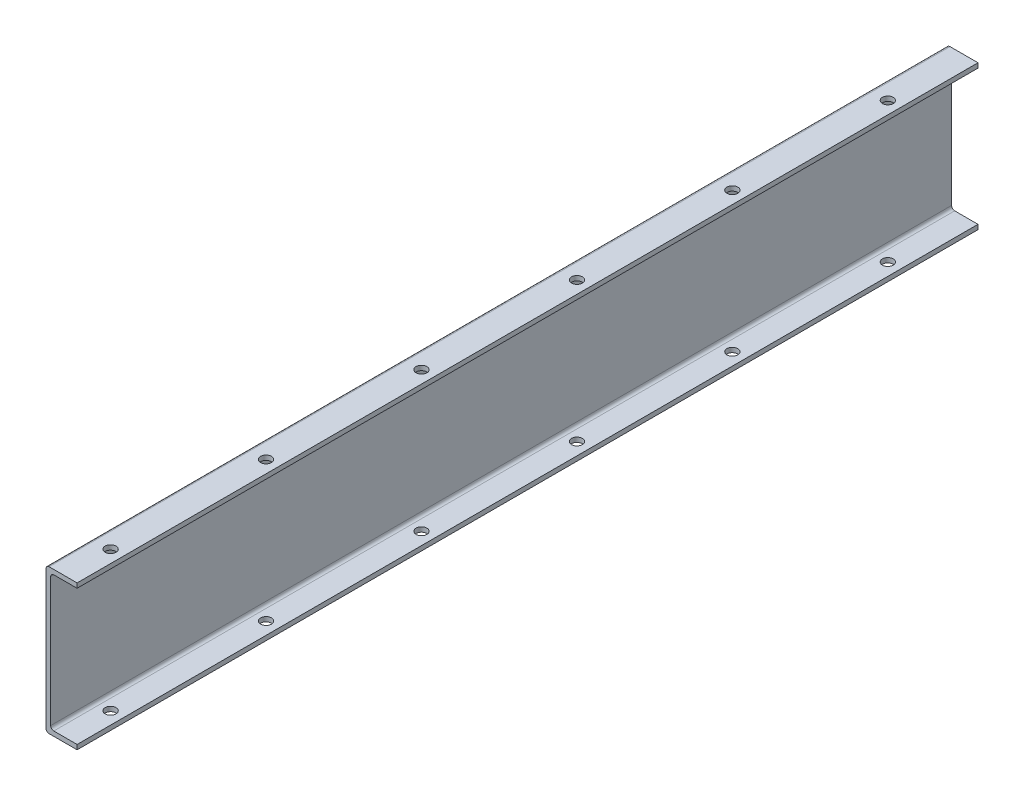
ISO-10303-21;
HEADER;
FILE_DESCRIPTION(('STEP AP214'),'2;1');
FILE_NAME('part.step','',(''),(''),'','','');
FILE_SCHEMA(('AUTOMOTIVE_DESIGN { 1 0 10303 214 1 1 1 1 }'));
ENDSEC;
DATA;
#1=APPLICATION_CONTEXT('core data for automotive mechanical design processes');
#2=APPLICATION_PROTOCOL_DEFINITION('international standard','automotive_design',2000,#1);
#3=PRODUCT_CONTEXT('',#1,'mechanical');
#4=PRODUCT('Part','Part','',(#3));
#5=PRODUCT_RELATED_PRODUCT_CATEGORY('part','',(#4));
#6=PRODUCT_DEFINITION_FORMATION('','',#4);
#7=PRODUCT_DEFINITION_CONTEXT('part definition',#1,'design');
#8=PRODUCT_DEFINITION('design','',#6,#7);
#9=PRODUCT_DEFINITION_SHAPE('','',#8);
#10=(LENGTH_UNIT() NAMED_UNIT(*) SI_UNIT(.MILLI.,.METRE.));
#11=(NAMED_UNIT(*) PLANE_ANGLE_UNIT() SI_UNIT($,.RADIAN.));
#12=(NAMED_UNIT(*) SI_UNIT($,.STERADIAN.) SOLID_ANGLE_UNIT());
#13=UNCERTAINTY_MEASURE_WITH_UNIT(LENGTH_MEASURE(1.E-05),#10,'distance_accuracy_value','');
#14=(GEOMETRIC_REPRESENTATION_CONTEXT(3) GLOBAL_UNCERTAINTY_ASSIGNED_CONTEXT((#13)) GLOBAL_UNIT_ASSIGNED_CONTEXT((#10,
#11,#12)) REPRESENTATION_CONTEXT('',''));
#15=CARTESIAN_POINT('',(0.,0.,0.));
#16=DIRECTION('',(0.,0.,1.));
#17=DIRECTION('',(1.,0.,0.));
#18=AXIS2_PLACEMENT_3D('',#15,#16,#17);
#19=CARTESIAN_POINT('',(0.75,0.,289.77));
#20=DIRECTION('',(1.,0.,0.));
#21=DIRECTION('',(0.,1.,0.));
#22=AXIS2_PLACEMENT_3D('',#19,#20,#21);
#23=PLANE('',#22);
#24=DIRECTION('',(0.,-1.,0.));
#25=VECTOR('',#24,1.);
#26=CARTESIAN_POINT('',(0.75,0.,289.77));
#27=LINE('',#26,#25);
#28=CARTESIAN_POINT('',(0.749999999999998,20.75,289.77));
#29=VERTEX_POINT('',#28);
#30=CARTESIAN_POINT('',(0.750000000000003,-20.75,289.77));
#31=VERTEX_POINT('',#30);
#32=EDGE_CURVE('E139',#29,#31,#27,.T.);
#33=ORIENTED_EDGE('',*,*,#32,.T.);
#34=DIRECTION('',(0.,0.,-1.));
#35=VECTOR('',#34,1.);
#36=CARTESIAN_POINT('',(0.750000000000003,-20.75,0.));
#37=LINE('',#36,#35);
#38=CARTESIAN_POINT('',(0.750000000000003,-20.75,0.));
#39=VERTEX_POINT('',#38);
#40=EDGE_CURVE('E195',#31,#39,#37,.T.);
#41=ORIENTED_EDGE('',*,*,#40,.T.);
#42=DIRECTION('',(0.,-1.,0.));
#43=VECTOR('',#42,1.);
#44=CARTESIAN_POINT('',(0.75,0.,0.));
#45=LINE('',#44,#43);
#46=CARTESIAN_POINT('',(0.749999999999998,20.75,0.));
#47=VERTEX_POINT('',#46);
#48=EDGE_CURVE('E169',#47,#39,#45,.T.);
#49=ORIENTED_EDGE('',*,*,#48,.F.);
#50=DIRECTION('',(0.,0.,-1.));
#51=VECTOR('',#50,1.);
#52=CARTESIAN_POINT('',(0.749999999999998,20.75,289.77));
#53=LINE('',#52,#51);
#54=EDGE_CURVE('E149',#47,#29,#53,.F.);
#55=ORIENTED_EDGE('',*,*,#54,.T.);
#56=EDGE_LOOP('',(#33,#41,#49,#55));
#57=FACE_BOUND('',#56,.T.);
#58=ADVANCED_FACE('F37',(#57),#23,.T.);
#59=CARTESIAN_POINT('',(0.,21.75,289.77));
#60=DIRECTION('',(0.,1.,0.));
#61=DIRECTION('',(0.,0.,1.));
#62=AXIS2_PLACEMENT_3D('',#59,#60,#61);
#63=PLANE('',#62);
#64=CARTESIAN_POINT('',(5.25000000000003,21.75,75.));
#65=DIRECTION('',(0.,1.,0.));
#66=DIRECTION('',(0.,0.,1.));
#67=AXIS2_PLACEMENT_3D('',#64,#65,#66);
#68=CIRCLE('',#67,1.75);
#69=CARTESIAN_POINT('',(5.25000000000003,21.75,76.75));
#70=VERTEX_POINT('',#69);
#71=EDGE_CURVE('E264',#70,#70,#68,.T.);
#72=ORIENTED_EDGE('',*,*,#71,.T.);
#73=EDGE_LOOP('',(#72));
#74=FACE_BOUND('',#73,.T.);
#75=CARTESIAN_POINT('',(5.25000000000002,21.75,125.));
#76=DIRECTION('',(0.,1.,0.));
#77=DIRECTION('',(0.,0.,1.));
#78=AXIS2_PLACEMENT_3D('',#75,#76,#77);
#79=CIRCLE('',#78,1.75);
#80=CARTESIAN_POINT('',(5.25000000000002,21.75,126.75));
#81=VERTEX_POINT('',#80);
#82=EDGE_CURVE('E249',#81,#81,#79,.T.);
#83=ORIENTED_EDGE('',*,*,#82,.T.);
#84=EDGE_LOOP('',(#83));
#85=FACE_BOUND('',#84,.T.);
#86=CARTESIAN_POINT('',(5.25000000000002,21.75,175.));
#87=DIRECTION('',(0.,1.,0.));
#88=DIRECTION('',(0.,0.,1.));
#89=AXIS2_PLACEMENT_3D('',#86,#87,#88);
#90=CIRCLE('',#89,1.75);
#91=CARTESIAN_POINT('',(5.25000000000002,21.75,176.75));
#92=VERTEX_POINT('',#91);
#93=EDGE_CURVE('E245',#92,#92,#90,.T.);
#94=ORIENTED_EDGE('',*,*,#93,.T.);
#95=EDGE_LOOP('',(#94));
#96=FACE_BOUND('',#95,.T.);
#97=CARTESIAN_POINT('',(5.25000000000001,21.75,225.));
#98=DIRECTION('',(0.,1.,0.));
#99=DIRECTION('',(0.,0.,1.));
#100=AXIS2_PLACEMENT_3D('',#97,#98,#99);
#101=CIRCLE('',#100,1.75);
#102=CARTESIAN_POINT('',(5.25000000000001,21.75,226.75));
#103=VERTEX_POINT('',#102);
#104=EDGE_CURVE('E241',#103,#103,#101,.T.);
#105=ORIENTED_EDGE('',*,*,#104,.T.);
#106=EDGE_LOOP('',(#105));
#107=FACE_BOUND('',#106,.T.);
#108=CARTESIAN_POINT('',(5.25,21.75,275.));
#109=DIRECTION('',(0.,1.,0.));
#110=DIRECTION('',(0.,0.,1.));
#111=AXIS2_PLACEMENT_3D('',#108,#109,#110);
#112=CIRCLE('',#111,1.75);
#113=CARTESIAN_POINT('',(5.25,21.75,276.75));
#114=VERTEX_POINT('',#113);
#115=EDGE_CURVE('E237',#114,#114,#112,.T.);
#116=ORIENTED_EDGE('',*,*,#115,.T.);
#117=EDGE_LOOP('',(#116));
#118=FACE_BOUND('',#117,.T.);
#119=CARTESIAN_POINT('',(5.25000000000003,21.75,25.));
#120=DIRECTION('',(0.,1.,0.));
#121=DIRECTION('',(0.,0.,1.));
#122=AXIS2_PLACEMENT_3D('',#119,#120,#121);
#123=CIRCLE('',#122,1.75);
#124=CARTESIAN_POINT('',(5.25000000000003,21.75,26.75));
#125=VERTEX_POINT('',#124);
#126=EDGE_CURVE('E172',#125,#125,#123,.T.);
#127=ORIENTED_EDGE('',*,*,#126,.T.);
#128=EDGE_LOOP('',(#127));
#129=FACE_BOUND('',#128,.T.);
#130=DIRECTION('',(1.,0.,0.));
#131=VECTOR('',#130,1.);
#132=CARTESIAN_POINT('',(0.,21.75,289.77));
#133=LINE('',#132,#131);
#134=CARTESIAN_POINT('',(1.75,21.75,289.77));
#135=VERTEX_POINT('',#134);
#136=CARTESIAN_POINT('',(9.25,21.75,289.77));
#137=VERTEX_POINT('',#136);
#138=EDGE_CURVE('E128',#135,#137,#133,.T.);
#139=ORIENTED_EDGE('',*,*,#138,.F.);
#140=DIRECTION('',(0.,0.,-1.));
#141=VECTOR('',#140,1.);
#142=CARTESIAN_POINT('',(1.75,21.75,289.77));
#143=LINE('',#142,#141);
#144=CARTESIAN_POINT('',(1.75,21.75,0.));
#145=VERTEX_POINT('',#144);
#146=EDGE_CURVE('E200',#135,#145,#143,.T.);
#147=ORIENTED_EDGE('',*,*,#146,.T.);
#148=DIRECTION('',(1.,0.,0.));
#149=VECTOR('',#148,1.);
#150=CARTESIAN_POINT('',(0.,21.75,0.));
#151=LINE('',#150,#149);
#152=CARTESIAN_POINT('',(9.25,21.75,0.));
#153=VERTEX_POINT('',#152);
#154=EDGE_CURVE('E145',#145,#153,#151,.T.);
#155=ORIENTED_EDGE('',*,*,#154,.T.);
#156=DIRECTION('',(0.,0.,-1.));
#157=VECTOR('',#156,1.);
#158=CARTESIAN_POINT('',(9.25,21.75,289.77));
#159=LINE('',#158,#157);
#160=EDGE_CURVE('E142',#137,#153,#159,.T.);
#161=ORIENTED_EDGE('',*,*,#160,.F.);
#162=EDGE_LOOP('',(#139,#147,#155,#161));
#163=FACE_BOUND('',#162,.T.);
#164=ADVANCED_FACE('F143',(#74,#85,#96,#107,#118,#129,#163),#63,.F.);
#165=CARTESIAN_POINT('',(9.25,0.,289.77));
#166=DIRECTION('',(-1.,0.,0.));
#167=DIRECTION('',(0.,0.,1.));
#168=AXIS2_PLACEMENT_3D('',#165,#166,#167);
#169=PLANE('',#168);
#170=DIRECTION('',(0.,1.,0.));
#171=VECTOR('',#170,1.);
#172=CARTESIAN_POINT('',(9.25,0.,0.));
#173=LINE('',#172,#171);
#174=CARTESIAN_POINT('',(9.25,23.25,0.));
#175=VERTEX_POINT('',#174);
#176=EDGE_CURVE('E174',#153,#175,#173,.T.);
#177=ORIENTED_EDGE('',*,*,#176,.T.);
#178=DIRECTION('',(0.,0.,-1.));
#179=VECTOR('',#178,1.);
#180=CARTESIAN_POINT('',(9.25,23.25,289.77));
#181=LINE('',#180,#179);
#182=CARTESIAN_POINT('',(9.25,23.25,289.77));
#183=VERTEX_POINT('',#182);
#184=EDGE_CURVE('E150',#183,#175,#181,.T.);
#185=ORIENTED_EDGE('',*,*,#184,.F.);
#186=DIRECTION('',(0.,1.,0.));
#187=VECTOR('',#186,1.);
#188=CARTESIAN_POINT('',(9.25,0.,289.77));
#189=LINE('',#188,#187);
#190=EDGE_CURVE('E132',#137,#183,#189,.T.);
#191=ORIENTED_EDGE('',*,*,#190,.F.);
#192=ORIENTED_EDGE('',*,*,#160,.T.);
#193=EDGE_LOOP('',(#177,#185,#191,#192));
#194=FACE_BOUND('',#193,.T.);
#195=ADVANCED_FACE('F152',(#194),#169,.F.);
#196=CARTESIAN_POINT('',(0.,23.25,289.77));
#197=DIRECTION('',(0.,1.,0.));
#198=DIRECTION('',(0.,0.,1.));
#199=AXIS2_PLACEMENT_3D('',#196,#197,#198);
#200=PLANE('',#199);
#201=CARTESIAN_POINT('',(5.25000000000003,23.25,75.));
#202=DIRECTION('',(0.,1.,0.));
#203=DIRECTION('',(0.,0.,1.));
#204=AXIS2_PLACEMENT_3D('',#201,#202,#203);
#205=CIRCLE('',#204,1.75);
#206=CARTESIAN_POINT('',(5.25000000000003,23.25,76.75));
#207=VERTEX_POINT('',#206);
#208=EDGE_CURVE('E261',#207,#207,#205,.T.);
#209=ORIENTED_EDGE('',*,*,#208,.F.);
#210=EDGE_LOOP('',(#209));
#211=FACE_BOUND('',#210,.T.);
#212=CARTESIAN_POINT('',(5.25000000000002,23.25,125.));
#213=DIRECTION('',(0.,1.,0.));
#214=DIRECTION('',(0.,0.,1.));
#215=AXIS2_PLACEMENT_3D('',#212,#213,#214);
#216=CIRCLE('',#215,1.75);
#217=CARTESIAN_POINT('',(5.25000000000002,23.25,126.75));
#218=VERTEX_POINT('',#217);
#219=EDGE_CURVE('E244',#218,#218,#216,.T.);
#220=ORIENTED_EDGE('',*,*,#219,.F.);
#221=EDGE_LOOP('',(#220));
#222=FACE_BOUND('',#221,.T.);
#223=CARTESIAN_POINT('',(5.25000000000002,23.25,175.));
#224=DIRECTION('',(0.,1.,0.));
#225=DIRECTION('',(0.,0.,1.));
#226=AXIS2_PLACEMENT_3D('',#223,#224,#225);
#227=CIRCLE('',#226,1.75);
#228=CARTESIAN_POINT('',(5.25000000000002,23.25,176.75));
#229=VERTEX_POINT('',#228);
#230=EDGE_CURVE('E240',#229,#229,#227,.T.);
#231=ORIENTED_EDGE('',*,*,#230,.F.);
#232=EDGE_LOOP('',(#231));
#233=FACE_BOUND('',#232,.T.);
#234=CARTESIAN_POINT('',(5.25000000000001,23.25,225.));
#235=DIRECTION('',(0.,1.,0.));
#236=DIRECTION('',(0.,0.,1.));
#237=AXIS2_PLACEMENT_3D('',#234,#235,#236);
#238=CIRCLE('',#237,1.75);
#239=CARTESIAN_POINT('',(5.25000000000001,23.25,226.75));
#240=VERTEX_POINT('',#239);
#241=EDGE_CURVE('E236',#240,#240,#238,.T.);
#242=ORIENTED_EDGE('',*,*,#241,.F.);
#243=EDGE_LOOP('',(#242));
#244=FACE_BOUND('',#243,.T.);
#245=CARTESIAN_POINT('',(5.25,23.25,275.));
#246=DIRECTION('',(0.,1.,0.));
#247=DIRECTION('',(0.,0.,1.));
#248=AXIS2_PLACEMENT_3D('',#245,#246,#247);
#249=CIRCLE('',#248,1.75);
#250=CARTESIAN_POINT('',(5.25,23.25,276.75));
#251=VERTEX_POINT('',#250);
#252=EDGE_CURVE('E231',#251,#251,#249,.T.);
#253=ORIENTED_EDGE('',*,*,#252,.F.);
#254=EDGE_LOOP('',(#253));
#255=FACE_BOUND('',#254,.T.);
#256=CARTESIAN_POINT('',(5.25000000000003,23.25,25.));
#257=DIRECTION('',(0.,1.,0.));
#258=DIRECTION('',(0.,0.,1.));
#259=AXIS2_PLACEMENT_3D('',#256,#257,#258);
#260=CIRCLE('',#259,1.75);
#261=CARTESIAN_POINT('',(5.25000000000003,23.25,26.75));
#262=VERTEX_POINT('',#261);
#263=EDGE_CURVE('E226',#262,#262,#260,.T.);
#264=ORIENTED_EDGE('',*,*,#263,.F.);
#265=EDGE_LOOP('',(#264));
#266=FACE_BOUND('',#265,.T.);
#267=DIRECTION('',(1.,0.,0.));
#268=VECTOR('',#267,1.);
#269=CARTESIAN_POINT('',(0.,23.25,0.));
#270=LINE('',#269,#268);
#271=CARTESIAN_POINT('',(0.249999999999997,23.25,0.));
#272=VERTEX_POINT('',#271);
#273=EDGE_CURVE('E176',#272,#175,#270,.T.);
#274=ORIENTED_EDGE('',*,*,#273,.F.);
#275=DIRECTION('',(0.,0.,-1.));
#276=VECTOR('',#275,1.);
#277=CARTESIAN_POINT('',(0.249999999999997,23.25,289.77));
#278=LINE('',#277,#276);
#279=CARTESIAN_POINT('',(0.249999999999997,23.25,289.77));
#280=VERTEX_POINT('',#279);
#281=EDGE_CURVE('E62',#272,#280,#278,.F.);
#282=ORIENTED_EDGE('',*,*,#281,.T.);
#283=DIRECTION('',(1.,0.,0.));
#284=VECTOR('',#283,1.);
#285=CARTESIAN_POINT('',(0.,23.25,289.77));
#286=LINE('',#285,#284);
#287=EDGE_CURVE('E154',#280,#183,#286,.T.);
#288=ORIENTED_EDGE('',*,*,#287,.T.);
#289=ORIENTED_EDGE('',*,*,#184,.T.);
#290=EDGE_LOOP('',(#274,#282,#288,#289));
#291=FACE_BOUND('',#290,.T.);
#292=ADVANCED_FACE('F307',(#211,#222,#233,#244,#255,#266,#291),#200,.T.);
#293=CARTESIAN_POINT('',(-0.75,0.,289.77));
#294=DIRECTION('',(1.,0.,0.));
#295=DIRECTION('',(0.,1.,0.));
#296=AXIS2_PLACEMENT_3D('',#293,#294,#295);
#297=PLANE('',#296);
#298=DIRECTION('',(0.,-1.,0.));
#299=VECTOR('',#298,1.);
#300=CARTESIAN_POINT('',(-0.75,0.,289.77));
#301=LINE('',#300,#299);
#302=CARTESIAN_POINT('',(-0.750000000000003,22.25,289.77));
#303=VERTEX_POINT('',#302);
#304=CARTESIAN_POINT('',(-0.749999999999997,-22.25,289.77));
#305=VERTEX_POINT('',#304);
#306=EDGE_CURVE('E156',#303,#305,#301,.T.);
#307=ORIENTED_EDGE('',*,*,#306,.F.);
#308=DIRECTION('',(0.,0.,-1.));
#309=VECTOR('',#308,1.);
#310=CARTESIAN_POINT('',(-0.750000000000003,22.25,0.));
#311=LINE('',#310,#309);
#312=CARTESIAN_POINT('',(-0.750000000000003,22.25,0.));
#313=VERTEX_POINT('',#312);
#314=EDGE_CURVE('E204',#303,#313,#311,.T.);
#315=ORIENTED_EDGE('',*,*,#314,.T.);
#316=DIRECTION('',(0.,-1.,0.));
#317=VECTOR('',#316,1.);
#318=CARTESIAN_POINT('',(-0.75,0.,0.));
#319=LINE('',#318,#317);
#320=CARTESIAN_POINT('',(-0.749999999999997,-22.25,0.));
#321=VERTEX_POINT('',#320);
#322=EDGE_CURVE('E178',#313,#321,#319,.T.);
#323=ORIENTED_EDGE('',*,*,#322,.T.);
#324=DIRECTION('',(0.,0.,-1.));
#325=VECTOR('',#324,1.);
#326=CARTESIAN_POINT('',(-0.749999999999997,-22.25,289.77));
#327=LINE('',#326,#325);
#328=EDGE_CURVE('E202',#321,#305,#327,.F.);
#329=ORIENTED_EDGE('',*,*,#328,.T.);
#330=EDGE_LOOP('',(#307,#315,#323,#329));
#331=FACE_BOUND('',#330,.T.);
#332=ADVANCED_FACE('F302',(#331),#297,.F.);
#333=CARTESIAN_POINT('',(0.,-23.25,289.77));
#334=DIRECTION('',(0.,1.,0.));
#335=DIRECTION('',(0.,0.,1.));
#336=AXIS2_PLACEMENT_3D('',#333,#334,#335);
#337=PLANE('',#336);
#338=CARTESIAN_POINT('',(5.25000000000003,-23.25,75.));
#339=DIRECTION('',(0.,-1.,0.));
#340=DIRECTION('',(0.,0.,-1.));
#341=AXIS2_PLACEMENT_3D('',#338,#339,#340);
#342=CIRCLE('',#341,1.75);
#343=CARTESIAN_POINT('',(5.25000000000003,-23.25,73.25));
#344=VERTEX_POINT('',#343);
#345=EDGE_CURVE('E232',#344,#344,#342,.T.);
#346=ORIENTED_EDGE('',*,*,#345,.F.);
#347=EDGE_LOOP('',(#346));
#348=FACE_BOUND('',#347,.T.);
#349=CARTESIAN_POINT('',(5.25000000000002,-23.25,125.));
#350=DIRECTION('',(0.,-1.,0.));
#351=DIRECTION('',(0.,0.,-1.));
#352=AXIS2_PLACEMENT_3D('',#349,#350,#351);
#353=CIRCLE('',#352,1.75);
#354=CARTESIAN_POINT('',(5.25000000000002,-23.25,123.25));
#355=VERTEX_POINT('',#354);
#356=EDGE_CURVE('E486',#355,#355,#353,.T.);
#357=ORIENTED_EDGE('',*,*,#356,.F.);
#358=EDGE_LOOP('',(#357));
#359=FACE_BOUND('',#358,.T.);
#360=CARTESIAN_POINT('',(5.25000000000002,-23.25,175.));
#361=DIRECTION('',(0.,-1.,0.));
#362=DIRECTION('',(0.,0.,-1.));
#363=AXIS2_PLACEMENT_3D('',#360,#361,#362);
#364=CIRCLE('',#363,1.75);
#365=CARTESIAN_POINT('',(5.25000000000002,-23.25,173.25));
#366=VERTEX_POINT('',#365);
#367=EDGE_CURVE('E483',#366,#366,#364,.T.);
#368=ORIENTED_EDGE('',*,*,#367,.F.);
#369=EDGE_LOOP('',(#368));
#370=FACE_BOUND('',#369,.T.);
#371=CARTESIAN_POINT('',(5.25000000000001,-23.25,225.));
#372=DIRECTION('',(0.,-1.,0.));
#373=DIRECTION('',(0.,0.,-1.));
#374=AXIS2_PLACEMENT_3D('',#371,#372,#373);
#375=CIRCLE('',#374,1.75);
#376=CARTESIAN_POINT('',(5.25000000000001,-23.25,223.25));
#377=VERTEX_POINT('',#376);
#378=EDGE_CURVE('E480',#377,#377,#375,.T.);
#379=ORIENTED_EDGE('',*,*,#378,.F.);
#380=EDGE_LOOP('',(#379));
#381=FACE_BOUND('',#380,.T.);
#382=CARTESIAN_POINT('',(5.25,-23.25,275.));
#383=DIRECTION('',(0.,-1.,0.));
#384=DIRECTION('',(0.,0.,-1.));
#385=AXIS2_PLACEMENT_3D('',#382,#383,#384);
#386=CIRCLE('',#385,1.75);
#387=CARTESIAN_POINT('',(5.25,-23.25,273.25));
#388=VERTEX_POINT('',#387);
#389=EDGE_CURVE('E475',#388,#388,#386,.T.);
#390=ORIENTED_EDGE('',*,*,#389,.F.);
#391=EDGE_LOOP('',(#390));
#392=FACE_BOUND('',#391,.T.);
#393=CARTESIAN_POINT('',(5.25000000000003,-23.25,25.));
#394=DIRECTION('',(0.,-1.,0.));
#395=DIRECTION('',(0.,0.,-1.));
#396=AXIS2_PLACEMENT_3D('',#393,#394,#395);
#397=CIRCLE('',#396,1.75);
#398=CARTESIAN_POINT('',(5.25000000000003,-23.25,23.25));
#399=VERTEX_POINT('',#398);
#400=EDGE_CURVE('E227',#399,#399,#397,.T.);
#401=ORIENTED_EDGE('',*,*,#400,.F.);
#402=EDGE_LOOP('',(#401));
#403=FACE_BOUND('',#402,.T.);
#404=DIRECTION('',(1.,0.,0.));
#405=VECTOR('',#404,1.);
#406=CARTESIAN_POINT('',(0.,-23.25,289.77));
#407=LINE('',#406,#405);
#408=CARTESIAN_POINT('',(0.250000000000003,-23.25,289.77));
#409=VERTEX_POINT('',#408);
#410=CARTESIAN_POINT('',(9.25,-23.25,289.77));
#411=VERTEX_POINT('',#410);
#412=EDGE_CURVE('E161',#409,#411,#407,.T.);
#413=ORIENTED_EDGE('',*,*,#412,.F.);
#414=DIRECTION('',(0.,0.,-1.));
#415=VECTOR('',#414,1.);
#416=CARTESIAN_POINT('',(0.250000000000003,-23.25,289.77));
#417=LINE('',#416,#415);
#418=CARTESIAN_POINT('',(0.250000000000003,-23.25,0.));
#419=VERTEX_POINT('',#418);
#420=EDGE_CURVE('E215',#409,#419,#417,.T.);
#421=ORIENTED_EDGE('',*,*,#420,.T.);
#422=DIRECTION('',(1.,0.,0.));
#423=VECTOR('',#422,1.);
#424=CARTESIAN_POINT('',(0.,-23.25,0.));
#425=LINE('',#424,#423);
#426=CARTESIAN_POINT('',(9.25,-23.25,0.));
#427=VERTEX_POINT('',#426);
#428=EDGE_CURVE('E181',#419,#427,#425,.T.);
#429=ORIENTED_EDGE('',*,*,#428,.T.);
#430=DIRECTION('',(0.,0.,-1.));
#431=VECTOR('',#430,1.);
#432=CARTESIAN_POINT('',(9.25,-23.25,289.77));
#433=LINE('',#432,#431);
#434=EDGE_CURVE('E190',#411,#427,#433,.T.);
#435=ORIENTED_EDGE('',*,*,#434,.F.);
#436=EDGE_LOOP('',(#413,#421,#429,#435));
#437=FACE_BOUND('',#436,.T.);
#438=ADVANCED_FACE('F296',(#348,#359,#370,#381,#392,#403,#437),#337,.F.);
#439=CARTESIAN_POINT('',(9.25000000000006,0.,289.77));
#440=DIRECTION('',(1.,0.,0.));
#441=DIRECTION('',(0.,1.,0.));
#442=AXIS2_PLACEMENT_3D('',#439,#440,#441);
#443=PLANE('',#442);
#444=DIRECTION('',(0.,-1.,0.));
#445=VECTOR('',#444,1.);
#446=CARTESIAN_POINT('',(9.25000000000006,0.,0.));
#447=LINE('',#446,#445);
#448=CARTESIAN_POINT('',(9.25000000000001,-21.75,0.));
#449=VERTEX_POINT('',#448);
#450=EDGE_CURVE('E183',#449,#427,#447,.T.);
#451=ORIENTED_EDGE('',*,*,#450,.F.);
#452=DIRECTION('',(0.,0.,-1.));
#453=VECTOR('',#452,1.);
#454=CARTESIAN_POINT('',(9.25000000000001,-21.75,289.77));
#455=LINE('',#454,#453);
#456=CARTESIAN_POINT('',(9.25000000000001,-21.75,289.77));
#457=VERTEX_POINT('',#456);
#458=EDGE_CURVE('E168',#457,#449,#455,.T.);
#459=ORIENTED_EDGE('',*,*,#458,.F.);
#460=DIRECTION('',(0.,-1.,0.));
#461=VECTOR('',#460,1.);
#462=CARTESIAN_POINT('',(9.25000000000006,0.,289.77));
#463=LINE('',#462,#461);
#464=EDGE_CURVE('E163',#457,#411,#463,.T.);
#465=ORIENTED_EDGE('',*,*,#464,.T.);
#466=ORIENTED_EDGE('',*,*,#434,.T.);
#467=EDGE_LOOP('',(#451,#459,#465,#466));
#468=FACE_BOUND('',#467,.T.);
#469=ADVANCED_FACE('F292',(#468),#443,.T.);
#470=CARTESIAN_POINT('',(0.,-21.75,289.77));
#471=DIRECTION('',(0.,1.,0.));
#472=DIRECTION('',(0.,0.,1.));
#473=AXIS2_PLACEMENT_3D('',#470,#471,#472);
#474=PLANE('',#473);
#475=CARTESIAN_POINT('',(5.25000000000003,-21.75,75.));
#476=DIRECTION('',(0.,1.,0.));
#477=DIRECTION('',(0.,0.,1.));
#478=AXIS2_PLACEMENT_3D('',#475,#476,#477);
#479=CIRCLE('',#478,1.75);
#480=CARTESIAN_POINT('',(5.25000000000003,-21.75,76.75));
#481=VERTEX_POINT('',#480);
#482=EDGE_CURVE('E41',#481,#481,#479,.T.);
#483=ORIENTED_EDGE('',*,*,#482,.F.);
#484=EDGE_LOOP('',(#483));
#485=FACE_BOUND('',#484,.T.);
#486=CARTESIAN_POINT('',(5.25000000000002,-21.75,125.));
#487=DIRECTION('',(0.,1.,0.));
#488=DIRECTION('',(0.,0.,1.));
#489=AXIS2_PLACEMENT_3D('',#486,#487,#488);
#490=CIRCLE('',#489,1.75);
#491=CARTESIAN_POINT('',(5.25000000000002,-21.75,126.75));
#492=VERTEX_POINT('',#491);
#493=EDGE_CURVE('E242',#492,#492,#490,.T.);
#494=ORIENTED_EDGE('',*,*,#493,.F.);
#495=EDGE_LOOP('',(#494));
#496=FACE_BOUND('',#495,.T.);
#497=CARTESIAN_POINT('',(5.25000000000002,-21.75,175.));
#498=DIRECTION('',(0.,1.,0.));
#499=DIRECTION('',(0.,0.,1.));
#500=AXIS2_PLACEMENT_3D('',#497,#498,#499);
#501=CIRCLE('',#500,1.75);
#502=CARTESIAN_POINT('',(5.25000000000002,-21.75,176.75));
#503=VERTEX_POINT('',#502);
#504=EDGE_CURVE('E238',#503,#503,#501,.T.);
#505=ORIENTED_EDGE('',*,*,#504,.F.);
#506=EDGE_LOOP('',(#505));
#507=FACE_BOUND('',#506,.T.);
#508=CARTESIAN_POINT('',(5.25000000000001,-21.75,225.));
#509=DIRECTION('',(0.,1.,0.));
#510=DIRECTION('',(0.,0.,1.));
#511=AXIS2_PLACEMENT_3D('',#508,#509,#510);
#512=CIRCLE('',#511,1.75);
#513=CARTESIAN_POINT('',(5.25000000000001,-21.75,226.75));
#514=VERTEX_POINT('',#513);
#515=EDGE_CURVE('E233',#514,#514,#512,.T.);
#516=ORIENTED_EDGE('',*,*,#515,.F.);
#517=EDGE_LOOP('',(#516));
#518=FACE_BOUND('',#517,.T.);
#519=CARTESIAN_POINT('',(5.25,-21.75,275.));
#520=DIRECTION('',(0.,1.,0.));
#521=DIRECTION('',(0.,0.,1.));
#522=AXIS2_PLACEMENT_3D('',#519,#520,#521);
#523=CIRCLE('',#522,1.75);
#524=CARTESIAN_POINT('',(5.25,-21.75,276.75));
#525=VERTEX_POINT('',#524);
#526=EDGE_CURVE('E228',#525,#525,#523,.T.);
#527=ORIENTED_EDGE('',*,*,#526,.F.);
#528=EDGE_LOOP('',(#527));
#529=FACE_BOUND('',#528,.T.);
#530=CARTESIAN_POINT('',(5.25000000000003,-21.75,25.));
#531=DIRECTION('',(0.,1.,0.));
#532=DIRECTION('',(0.,0.,1.));
#533=AXIS2_PLACEMENT_3D('',#530,#531,#532);
#534=CIRCLE('',#533,1.75);
#535=CARTESIAN_POINT('',(5.25000000000003,-21.75,26.75));
#536=VERTEX_POINT('',#535);
#537=EDGE_CURVE('E223',#536,#536,#534,.T.);
#538=ORIENTED_EDGE('',*,*,#537,.F.);
#539=EDGE_LOOP('',(#538));
#540=FACE_BOUND('',#539,.T.);
#541=DIRECTION('',(1.,0.,0.));
#542=VECTOR('',#541,1.);
#543=CARTESIAN_POINT('',(0.,-21.75,0.));
#544=LINE('',#543,#542);
#545=CARTESIAN_POINT('',(1.75,-21.75,0.));
#546=VERTEX_POINT('',#545);
#547=EDGE_CURVE('E186',#546,#449,#544,.T.);
#548=ORIENTED_EDGE('',*,*,#547,.F.);
#549=DIRECTION('',(0.,0.,-1.));
#550=VECTOR('',#549,1.);
#551=CARTESIAN_POINT('',(1.75,-21.75,289.77));
#552=LINE('',#551,#550);
#553=CARTESIAN_POINT('',(1.75,-21.75,289.77));
#554=VERTEX_POINT('',#553);
#555=EDGE_CURVE('E198',#546,#554,#552,.F.);
#556=ORIENTED_EDGE('',*,*,#555,.T.);
#557=DIRECTION('',(1.,0.,0.));
#558=VECTOR('',#557,1.);
#559=CARTESIAN_POINT('',(0.,-21.75,289.77));
#560=LINE('',#559,#558);
#561=EDGE_CURVE('E166',#554,#457,#560,.T.);
#562=ORIENTED_EDGE('',*,*,#561,.T.);
#563=ORIENTED_EDGE('',*,*,#458,.T.);
#564=EDGE_LOOP('',(#548,#556,#562,#563));
#565=FACE_BOUND('',#564,.T.);
#566=ADVANCED_FACE('F286',(#485,#496,#507,#518,#529,#540,#565),#474,.T.);
#567=CARTESIAN_POINT('',(0.,0.,289.77));
#568=DIRECTION('',(0.,0.,1.));
#569=DIRECTION('',(1.,0.,0.));
#570=AXIS2_PLACEMENT_3D('',#567,#568,#569);
#571=PLANE('',#570);
#572=ORIENTED_EDGE('',*,*,#287,.F.);
#573=CARTESIAN_POINT('',(0.249999999999997,22.25,289.77));
#574=DIRECTION('',(0.,0.,1.));
#575=DIRECTION('',(1.,0.,0.));
#576=AXIS2_PLACEMENT_3D('',#573,#574,#575);
#577=CIRCLE('',#576,1.);
#578=EDGE_CURVE('E213',#280,#303,#577,.T.);
#579=ORIENTED_EDGE('',*,*,#578,.T.);
#580=ORIENTED_EDGE('',*,*,#306,.T.);
#581=CARTESIAN_POINT('',(0.250000000000003,-22.25,289.77));
#582=DIRECTION('',(0.,0.,1.));
#583=DIRECTION('',(1.,0.,0.));
#584=AXIS2_PLACEMENT_3D('',#581,#582,#583);
#585=CIRCLE('',#584,1.);
#586=EDGE_CURVE('E54',#305,#409,#585,.T.);
#587=ORIENTED_EDGE('',*,*,#586,.T.);
#588=ORIENTED_EDGE('',*,*,#412,.T.);
#589=ORIENTED_EDGE('',*,*,#464,.F.);
#590=ORIENTED_EDGE('',*,*,#561,.F.);
#591=CARTESIAN_POINT('',(1.75,-20.75,289.77));
#592=DIRECTION('',(0.,0.,1.));
#593=DIRECTION('',(1.,0.,0.));
#594=AXIS2_PLACEMENT_3D('',#591,#592,#593);
#595=CIRCLE('',#594,1.);
#596=EDGE_CURVE('E220',#554,#31,#595,.F.);
#597=ORIENTED_EDGE('',*,*,#596,.T.);
#598=ORIENTED_EDGE('',*,*,#32,.F.);
#599=CARTESIAN_POINT('',(1.75,20.75,289.77));
#600=DIRECTION('',(0.,0.,1.));
#601=DIRECTION('',(1.,0.,0.));
#602=AXIS2_PLACEMENT_3D('',#599,#600,#601);
#603=CIRCLE('',#602,1.);
#604=EDGE_CURVE('E11',#29,#135,#603,.F.);
#605=ORIENTED_EDGE('',*,*,#604,.T.);
#606=ORIENTED_EDGE('',*,*,#138,.T.);
#607=ORIENTED_EDGE('',*,*,#190,.T.);
#608=EDGE_LOOP('',(#572,#579,#580,#587,#588,#589,#590,#597,#598,#605,#606,#607));
#609=FACE_BOUND('',#608,.T.);
#610=ADVANCED_FACE('F130',(#609),#571,.T.);
#611=CARTESIAN_POINT('',(0.,0.,0.));
#612=DIRECTION('',(0.,0.,1.));
#613=DIRECTION('',(1.,0.,0.));
#614=AXIS2_PLACEMENT_3D('',#611,#612,#613);
#615=PLANE('',#614);
#616=ORIENTED_EDGE('',*,*,#322,.F.);
#617=CARTESIAN_POINT('',(0.249999999999997,22.25,0.));
#618=DIRECTION('',(0.,0.,1.));
#619=DIRECTION('',(1.,0.,0.));
#620=AXIS2_PLACEMENT_3D('',#617,#618,#619);
#621=CIRCLE('',#620,1.);
#622=EDGE_CURVE('E209',#313,#272,#621,.F.);
#623=ORIENTED_EDGE('',*,*,#622,.T.);
#624=ORIENTED_EDGE('',*,*,#273,.T.);
#625=ORIENTED_EDGE('',*,*,#176,.F.);
#626=ORIENTED_EDGE('',*,*,#154,.F.);
#627=CARTESIAN_POINT('',(1.75,20.75,0.));
#628=DIRECTION('',(0.,0.,1.));
#629=DIRECTION('',(1.,0.,0.));
#630=AXIS2_PLACEMENT_3D('',#627,#628,#629);
#631=CIRCLE('',#630,1.);
#632=EDGE_CURVE('E46',#145,#47,#631,.T.);
#633=ORIENTED_EDGE('',*,*,#632,.T.);
#634=ORIENTED_EDGE('',*,*,#48,.T.);
#635=CARTESIAN_POINT('',(1.75,-20.75,0.));
#636=DIRECTION('',(0.,0.,1.));
#637=DIRECTION('',(1.,0.,0.));
#638=AXIS2_PLACEMENT_3D('',#635,#636,#637);
#639=CIRCLE('',#638,1.);
#640=EDGE_CURVE('E218',#39,#546,#639,.T.);
#641=ORIENTED_EDGE('',*,*,#640,.T.);
#642=ORIENTED_EDGE('',*,*,#547,.T.);
#643=ORIENTED_EDGE('',*,*,#450,.T.);
#644=ORIENTED_EDGE('',*,*,#428,.F.);
#645=CARTESIAN_POINT('',(0.250000000000003,-22.25,0.));
#646=DIRECTION('',(0.,0.,1.));
#647=DIRECTION('',(1.,0.,0.));
#648=AXIS2_PLACEMENT_3D('',#645,#646,#647);
#649=CIRCLE('',#648,1.);
#650=EDGE_CURVE('E207',#419,#321,#649,.F.);
#651=ORIENTED_EDGE('',*,*,#650,.T.);
#652=EDGE_LOOP('',(#616,#623,#624,#625,#626,#633,#634,#641,#642,#643,#644,#651));
#653=FACE_BOUND('',#652,.T.);
#654=ADVANCED_FACE('F284',(#653),#615,.F.);
#655=CARTESIAN_POINT('',(1.75,-20.75,289.77));
#656=DIRECTION('',(0.,0.,1.));
#657=DIRECTION('',(1.,0.,0.));
#658=AXIS2_PLACEMENT_3D('',#655,#656,#657);
#659=CYLINDRICAL_SURFACE('',#658,1.);
#660=ORIENTED_EDGE('',*,*,#596,.F.);
#661=ORIENTED_EDGE('',*,*,#555,.F.);
#662=ORIENTED_EDGE('',*,*,#640,.F.);
#663=ORIENTED_EDGE('',*,*,#40,.F.);
#664=EDGE_LOOP('',(#660,#661,#662,#663));
#665=FACE_BOUND('',#664,.T.);
#666=ADVANCED_FACE('F279',(#665),#659,.F.);
#667=CARTESIAN_POINT('',(1.75,20.75,289.77));
#668=DIRECTION('',(0.,0.,-1.));
#669=DIRECTION('',(-1.,0.,0.));
#670=AXIS2_PLACEMENT_3D('',#667,#668,#669);
#671=CYLINDRICAL_SURFACE('',#670,1.);
#672=ORIENTED_EDGE('',*,*,#604,.F.);
#673=ORIENTED_EDGE('',*,*,#54,.F.);
#674=ORIENTED_EDGE('',*,*,#632,.F.);
#675=ORIENTED_EDGE('',*,*,#146,.F.);
#676=EDGE_LOOP('',(#672,#673,#674,#675));
#677=FACE_BOUND('',#676,.T.);
#678=ADVANCED_FACE('F309',(#677),#671,.F.);
#679=CARTESIAN_POINT('',(0.249999999999997,22.25,289.77));
#680=DIRECTION('',(0.,0.,1.));
#681=DIRECTION('',(1.,0.,0.));
#682=AXIS2_PLACEMENT_3D('',#679,#680,#681);
#683=CYLINDRICAL_SURFACE('',#682,1.);
#684=ORIENTED_EDGE('',*,*,#578,.F.);
#685=ORIENTED_EDGE('',*,*,#281,.F.);
#686=ORIENTED_EDGE('',*,*,#622,.F.);
#687=ORIENTED_EDGE('',*,*,#314,.F.);
#688=EDGE_LOOP('',(#684,#685,#686,#687));
#689=FACE_BOUND('',#688,.T.);
#690=ADVANCED_FACE('F306',(#689),#683,.T.);
#691=CARTESIAN_POINT('',(0.250000000000003,-22.25,289.77));
#692=DIRECTION('',(0.,0.,-1.));
#693=DIRECTION('',(-1.,0.,0.));
#694=AXIS2_PLACEMENT_3D('',#691,#692,#693);
#695=CYLINDRICAL_SURFACE('',#694,1.);
#696=ORIENTED_EDGE('',*,*,#586,.F.);
#697=ORIENTED_EDGE('',*,*,#328,.F.);
#698=ORIENTED_EDGE('',*,*,#650,.F.);
#699=ORIENTED_EDGE('',*,*,#420,.F.);
#700=EDGE_LOOP('',(#696,#697,#698,#699));
#701=FACE_BOUND('',#700,.T.);
#702=ADVANCED_FACE('F39',(#701),#695,.T.);
#703=CARTESIAN_POINT('',(5.25000000000003,223.13,25.));
#704=DIRECTION('',(0.,-1.,0.));
#705=DIRECTION('',(0.,0.,-1.));
#706=AXIS2_PLACEMENT_3D('',#703,#704,#705);
#707=CYLINDRICAL_SURFACE('',#706,1.75);
#708=ORIENTED_EDGE('',*,*,#537,.T.);
#709=EDGE_LOOP('',(#708));
#710=FACE_BOUND('',#709,.T.);
#711=ORIENTED_EDGE('',*,*,#400,.T.);
#712=EDGE_LOOP('',(#711));
#713=FACE_BOUND('',#712,.T.);
#714=ADVANCED_FACE('F344',(#710,#713),#707,.F.);
#715=ORIENTED_EDGE('',*,*,#263,.T.);
#716=EDGE_LOOP('',(#715));
#717=FACE_BOUND('',#716,.T.);
#718=ORIENTED_EDGE('',*,*,#126,.F.);
#719=EDGE_LOOP('',(#718));
#720=FACE_BOUND('',#719,.T.);
#721=ADVANCED_FACE('F347',(#717,#720),#707,.F.);
#722=CARTESIAN_POINT('',(5.25,223.13,275.));
#723=DIRECTION('',(0.,-1.,0.));
#724=DIRECTION('',(0.,0.,-1.));
#725=AXIS2_PLACEMENT_3D('',#722,#723,#724);
#726=CYLINDRICAL_SURFACE('',#725,1.75);
#727=ORIENTED_EDGE('',*,*,#526,.T.);
#728=EDGE_LOOP('',(#727));
#729=FACE_BOUND('',#728,.T.);
#730=ORIENTED_EDGE('',*,*,#389,.T.);
#731=EDGE_LOOP('',(#730));
#732=FACE_BOUND('',#731,.T.);
#733=ADVANCED_FACE('F349',(#729,#732),#726,.F.);
#734=CARTESIAN_POINT('',(5.25000000000001,223.13,225.));
#735=DIRECTION('',(0.,-1.,0.));
#736=DIRECTION('',(0.,0.,-1.));
#737=AXIS2_PLACEMENT_3D('',#734,#735,#736);
#738=CYLINDRICAL_SURFACE('',#737,1.75);
#739=ORIENTED_EDGE('',*,*,#515,.T.);
#740=EDGE_LOOP('',(#739));
#741=FACE_BOUND('',#740,.T.);
#742=ORIENTED_EDGE('',*,*,#378,.T.);
#743=EDGE_LOOP('',(#742));
#744=FACE_BOUND('',#743,.T.);
#745=ADVANCED_FACE('F352',(#741,#744),#738,.F.);
#746=CARTESIAN_POINT('',(5.25000000000002,223.13,175.));
#747=DIRECTION('',(0.,-1.,0.));
#748=DIRECTION('',(0.,0.,-1.));
#749=AXIS2_PLACEMENT_3D('',#746,#747,#748);
#750=CYLINDRICAL_SURFACE('',#749,1.75);
#751=ORIENTED_EDGE('',*,*,#504,.T.);
#752=EDGE_LOOP('',(#751));
#753=FACE_BOUND('',#752,.T.);
#754=ORIENTED_EDGE('',*,*,#367,.T.);
#755=EDGE_LOOP('',(#754));
#756=FACE_BOUND('',#755,.T.);
#757=ADVANCED_FACE('F357',(#753,#756),#750,.F.);
#758=CARTESIAN_POINT('',(5.25000000000002,223.13,125.));
#759=DIRECTION('',(0.,-1.,0.));
#760=DIRECTION('',(0.,0.,-1.));
#761=AXIS2_PLACEMENT_3D('',#758,#759,#760);
#762=CYLINDRICAL_SURFACE('',#761,1.75);
#763=ORIENTED_EDGE('',*,*,#493,.T.);
#764=EDGE_LOOP('',(#763));
#765=FACE_BOUND('',#764,.T.);
#766=ORIENTED_EDGE('',*,*,#356,.T.);
#767=EDGE_LOOP('',(#766));
#768=FACE_BOUND('',#767,.T.);
#769=ADVANCED_FACE('F362',(#765,#768),#762,.F.);
#770=CARTESIAN_POINT('',(5.25000000000003,223.13,75.));
#771=DIRECTION('',(0.,-1.,0.));
#772=DIRECTION('',(0.,0.,-1.));
#773=AXIS2_PLACEMENT_3D('',#770,#771,#772);
#774=CYLINDRICAL_SURFACE('',#773,1.75);
#775=ORIENTED_EDGE('',*,*,#482,.T.);
#776=EDGE_LOOP('',(#775));
#777=FACE_BOUND('',#776,.T.);
#778=ORIENTED_EDGE('',*,*,#345,.T.);
#779=EDGE_LOOP('',(#778));
#780=FACE_BOUND('',#779,.T.);
#781=ADVANCED_FACE('F367',(#777,#780),#774,.F.);
#782=ORIENTED_EDGE('',*,*,#252,.T.);
#783=EDGE_LOOP('',(#782));
#784=FACE_BOUND('',#783,.T.);
#785=ORIENTED_EDGE('',*,*,#115,.F.);
#786=EDGE_LOOP('',(#785));
#787=FACE_BOUND('',#786,.T.);
#788=ADVANCED_FACE('F354',(#784,#787),#726,.F.);
#789=ORIENTED_EDGE('',*,*,#241,.T.);
#790=EDGE_LOOP('',(#789));
#791=FACE_BOUND('',#790,.T.);
#792=ORIENTED_EDGE('',*,*,#104,.F.);
#793=EDGE_LOOP('',(#792));
#794=FACE_BOUND('',#793,.T.);
#795=ADVANCED_FACE('F359',(#791,#794),#738,.F.);
#796=ORIENTED_EDGE('',*,*,#230,.T.);
#797=EDGE_LOOP('',(#796));
#798=FACE_BOUND('',#797,.T.);
#799=ORIENTED_EDGE('',*,*,#93,.F.);
#800=EDGE_LOOP('',(#799));
#801=FACE_BOUND('',#800,.T.);
#802=ADVANCED_FACE('F364',(#798,#801),#750,.F.);
#803=ORIENTED_EDGE('',*,*,#219,.T.);
#804=EDGE_LOOP('',(#803));
#805=FACE_BOUND('',#804,.T.);
#806=ORIENTED_EDGE('',*,*,#82,.F.);
#807=EDGE_LOOP('',(#806));
#808=FACE_BOUND('',#807,.T.);
#809=ADVANCED_FACE('F368',(#805,#808),#762,.F.);
#810=ORIENTED_EDGE('',*,*,#208,.T.);
#811=EDGE_LOOP('',(#810));
#812=FACE_BOUND('',#811,.T.);
#813=ORIENTED_EDGE('',*,*,#71,.F.);
#814=EDGE_LOOP('',(#813));
#815=FACE_BOUND('',#814,.T.);
#816=ADVANCED_FACE('F371',(#812,#815),#774,.F.);
#817=CLOSED_SHELL('',(#58,#164,#195,#292,#332,#438,#469,#566,#610,#654,#666,#678,#690,#702,#714,
#721,#733,#745,#757,#769,#781,#788,#795,#802,#809,#816));
#818=MANIFOLD_SOLID_BREP('B2',#817);
#819=ADVANCED_BREP_SHAPE_REPRESENTATION('',(#18,#818),#14);
#820=SHAPE_DEFINITION_REPRESENTATION(#9,#819);
ENDSEC;
END-ISO-10303-21;
